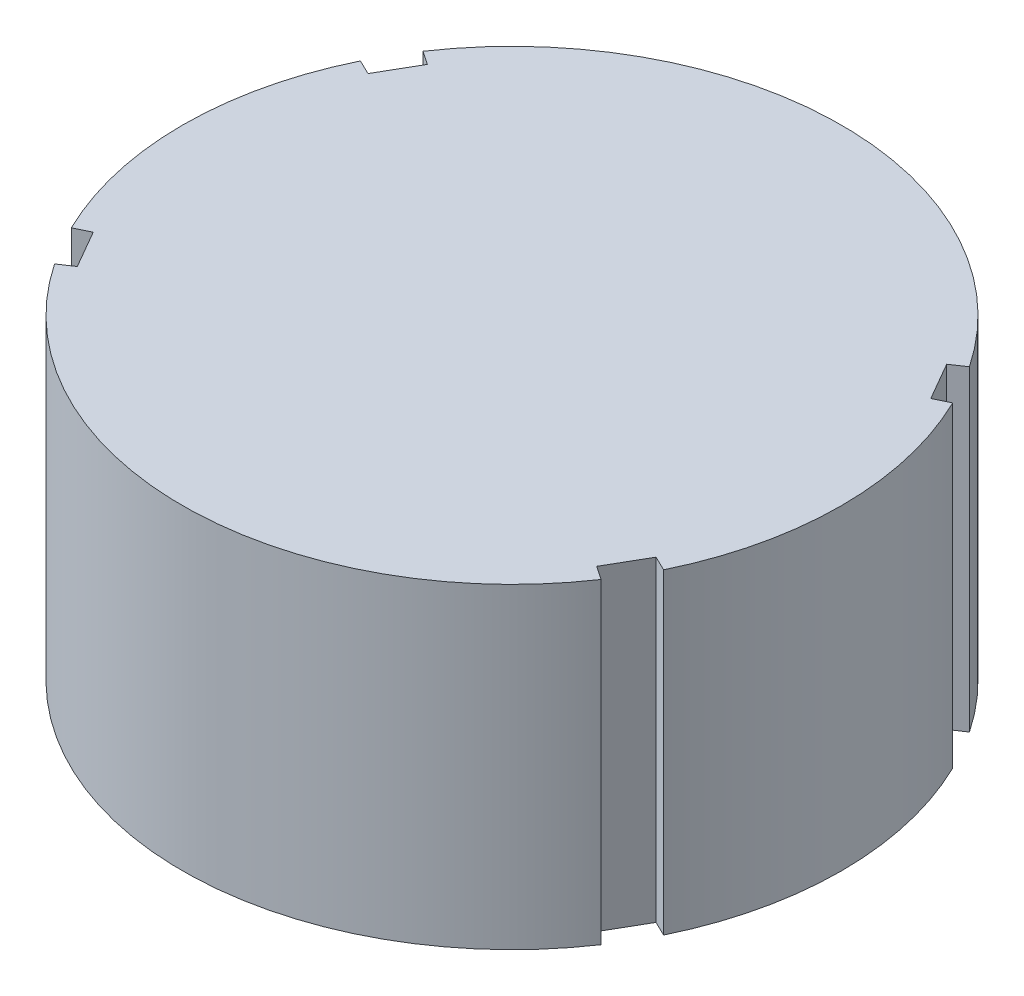
ISO-10303-21;
HEADER;
FILE_DESCRIPTION(('STEP AP214'),'2;1');
FILE_NAME('part.step','',(''),(''),'','','');
FILE_SCHEMA(('AUTOMOTIVE_DESIGN { 1 0 10303 214 1 1 1 1 }'));
ENDSEC;
DATA;
#1=APPLICATION_CONTEXT('core data for automotive mechanical design processes');
#2=APPLICATION_PROTOCOL_DEFINITION('international standard','automotive_design',2000,#1);
#3=PRODUCT_CONTEXT('',#1,'mechanical');
#4=PRODUCT('Part','Part','',(#3));
#5=PRODUCT_RELATED_PRODUCT_CATEGORY('part','',(#4));
#6=PRODUCT_DEFINITION_FORMATION('','',#4);
#7=PRODUCT_DEFINITION_CONTEXT('part definition',#1,'design');
#8=PRODUCT_DEFINITION('design','',#6,#7);
#9=PRODUCT_DEFINITION_SHAPE('','',#8);
#10=(LENGTH_UNIT() NAMED_UNIT(*) SI_UNIT(.MILLI.,.METRE.));
#11=(NAMED_UNIT(*) PLANE_ANGLE_UNIT() SI_UNIT($,.RADIAN.));
#12=(NAMED_UNIT(*) SI_UNIT($,.STERADIAN.) SOLID_ANGLE_UNIT());
#13=UNCERTAINTY_MEASURE_WITH_UNIT(LENGTH_MEASURE(1.E-05),#10,'distance_accuracy_value','');
#14=(GEOMETRIC_REPRESENTATION_CONTEXT(3) GLOBAL_UNCERTAINTY_ASSIGNED_CONTEXT((#13)) GLOBAL_UNIT_ASSIGNED_CONTEXT((#10,
#11,#12)) REPRESENTATION_CONTEXT('',''));
#15=CARTESIAN_POINT('',(0.,0.,0.));
#16=DIRECTION('',(0.,0.,1.));
#17=DIRECTION('',(1.,0.,0.));
#18=AXIS2_PLACEMENT_3D('',#15,#16,#17);
#19=CARTESIAN_POINT('',(-20.5248020696783,24.,-11.850000000011));
#20=DIRECTION('',(-0.866025403784102,0.,-0.500000000000584));
#21=DIRECTION('',(-0.500000000000584,0.,0.866025403784102));
#22=AXIS2_PLACEMENT_3D('',#19,#20,#21);
#23=PLANE('',#22);
#24=DIRECTION('',(0.500000000000584,0.,-0.866025403784102));
#25=VECTOR('',#24,1.);
#26=CARTESIAN_POINT('',(-20.5248020696783,0.,-11.850000000011));
#27=LINE('',#26,#25);
#28=CARTESIAN_POINT('',(-21.3498020696849,0.,-10.4210580837576));
#29=VERTEX_POINT('',#28);
#30=CARTESIAN_POINT('',(-19.699802069683,0.,-13.2789419162451));
#31=VERTEX_POINT('',#30);
#32=EDGE_CURVE('E192',#29,#31,#27,.T.);
#33=ORIENTED_EDGE('',*,*,#32,.F.);
#34=DIRECTION('',(0.,-1.,0.));
#35=VECTOR('',#34,1.);
#36=CARTESIAN_POINT('',(-21.3498020696849,24.,-10.4210580837576));
#37=LINE('',#36,#35);
#38=CARTESIAN_POINT('',(-21.3498020696849,24.,-10.4210580837576));
#39=VERTEX_POINT('',#38);
#40=EDGE_CURVE('E11',#39,#29,#37,.T.);
#41=ORIENTED_EDGE('',*,*,#40,.F.);
#42=DIRECTION('',(0.500000000000584,0.,-0.866025403784102));
#43=VECTOR('',#42,1.);
#44=CARTESIAN_POINT('',(-20.5248020696783,24.,-11.850000000011));
#45=LINE('',#44,#43);
#46=CARTESIAN_POINT('',(-19.699802069683,24.,-13.2789419162451));
#47=VERTEX_POINT('',#46);
#48=EDGE_CURVE('E249',#39,#47,#45,.T.);
#49=ORIENTED_EDGE('',*,*,#48,.T.);
#50=DIRECTION('',(0.,-1.,0.));
#51=VECTOR('',#50,1.);
#52=CARTESIAN_POINT('',(-19.699802069683,24.,-13.2789419162451));
#53=LINE('',#52,#51);
#54=EDGE_CURVE('E62',#47,#31,#53,.T.);
#55=ORIENTED_EDGE('',*,*,#54,.T.);
#56=EDGE_LOOP('',(#33,#41,#49,#55));
#57=FACE_BOUND('',#56,.T.);
#58=ADVANCED_FACE('F45',(#57),#23,.T.);
#59=CARTESIAN_POINT('',(-5.03430191318069E-12,24.,1.03138614660285E-11));
#60=DIRECTION('',(-0.438645324696902,0.,0.898660269023589));
#61=DIRECTION('',(0.898660269023589,0.,0.438645324696902));
#62=AXIS2_PLACEMENT_3D('',#59,#60,#61);
#63=PLANE('',#62);
#64=DIRECTION('',(-0.898660269023589,0.,-0.438645324696902));
#65=VECTOR('',#64,1.);
#66=CARTESIAN_POINT('',(-5.03430191318069E-12,0.,1.03138614660285E-11));
#67=LINE('',#66,#65);
#68=CARTESIAN_POINT('',(-22.46650672559,0.,-10.9661331174099));
#69=VERTEX_POINT('',#68);
#70=EDGE_CURVE('E195',#29,#69,#67,.T.);
#71=ORIENTED_EDGE('',*,*,#70,.T.);
#72=DIRECTION('',(0.,-1.,0.));
#73=VECTOR('',#72,1.);
#74=CARTESIAN_POINT('',(-22.46650672559,24.,-10.9661331174099));
#75=LINE('',#74,#73);
#76=CARTESIAN_POINT('',(-22.46650672559,24.,-10.9661331174099));
#77=VERTEX_POINT('',#76);
#78=EDGE_CURVE('E54',#77,#69,#75,.T.);
#79=ORIENTED_EDGE('',*,*,#78,.F.);
#80=DIRECTION('',(-0.898660269023589,0.,-0.438645324696902));
#81=VECTOR('',#80,1.);
#82=CARTESIAN_POINT('',(-5.03430191318069E-12,24.,1.03138614660285E-11));
#83=LINE('',#82,#81);
#84=EDGE_CURVE('E317',#39,#77,#83,.T.);
#85=ORIENTED_EDGE('',*,*,#84,.F.);
#86=ORIENTED_EDGE('',*,*,#40,.T.);
#87=EDGE_LOOP('',(#71,#79,#85,#86));
#88=FACE_BOUND('',#87,.T.);
#89=ADVANCED_FACE('F359',(#88),#63,.F.);
#90=CARTESIAN_POINT('',(0.,24.,0.));
#91=DIRECTION('',(0.,-1.,0.));
#92=DIRECTION('',(0.,0.,-1.));
#93=AXIS2_PLACEMENT_3D('',#90,#91,#92);
#94=CYLINDRICAL_SURFACE('',#93,25.);
#95=CARTESIAN_POINT('',(0.,0.,0.));
#96=DIRECTION('',(0.,1.,0.));
#97=DIRECTION('',(0.,0.,1.));
#98=AXIS2_PLACEMENT_3D('',#95,#96,#97);
#99=CIRCLE('',#98,25.);
#100=CARTESIAN_POINT('',(-22.4665067255956,0.,10.966133117409));
#101=VERTEX_POINT('',#100);
#102=EDGE_CURVE('E198',#69,#101,#99,.T.);
#103=ORIENTED_EDGE('',*,*,#102,.T.);
#104=DIRECTION('',(0.,-1.,0.));
#105=VECTOR('',#104,1.);
#106=CARTESIAN_POINT('',(-22.4665067255956,24.,10.966133117409));
#107=LINE('',#106,#105);
#108=CARTESIAN_POINT('',(-22.4665067255956,24.,10.966133117409));
#109=VERTEX_POINT('',#108);
#110=EDGE_CURVE('E285',#109,#101,#107,.T.);
#111=ORIENTED_EDGE('',*,*,#110,.F.);
#112=CARTESIAN_POINT('',(0.,24.,0.));
#113=DIRECTION('',(0.,1.,0.));
#114=DIRECTION('',(0.,0.,1.));
#115=AXIS2_PLACEMENT_3D('',#112,#113,#114);
#116=CIRCLE('',#115,25.);
#117=EDGE_CURVE('E295',#77,#109,#116,.T.);
#118=ORIENTED_EDGE('',*,*,#117,.F.);
#119=ORIENTED_EDGE('',*,*,#78,.T.);
#120=EDGE_LOOP('',(#103,#111,#118,#119));
#121=FACE_BOUND('',#120,.T.);
#122=ADVANCED_FACE('F293',(#121),#94,.T.);
#123=CARTESIAN_POINT('',(6.4077775711597E-12,24.,1.31277248194491E-11));
#124=DIRECTION('',(0.438645324695846,0.,0.898660269024104));
#125=DIRECTION('',(0.898660269024104,0.,-0.438645324695847));
#126=AXIS2_PLACEMENT_3D('',#123,#124,#125);
#127=PLANE('',#126);
#128=DIRECTION('',(-0.898660269024104,0.,0.438645324695847));
#129=VECTOR('',#128,1.);
#130=CARTESIAN_POINT('',(6.4077775711597E-12,0.,1.31277248194491E-11));
#131=LINE('',#130,#129);
#132=CARTESIAN_POINT('',(-21.3498020696898,0.,10.421058083758));
#133=VERTEX_POINT('',#132);
#134=EDGE_CURVE('E202',#133,#101,#131,.T.);
#135=ORIENTED_EDGE('',*,*,#134,.F.);
#136=DIRECTION('',(0.,-1.,0.));
#137=VECTOR('',#136,1.);
#138=CARTESIAN_POINT('',(-21.3498020696898,24.,10.421058083758));
#139=LINE('',#138,#137);
#140=CARTESIAN_POINT('',(-21.3498020696898,24.,10.421058083758));
#141=VERTEX_POINT('',#140);
#142=EDGE_CURVE('E282',#141,#133,#139,.T.);
#143=ORIENTED_EDGE('',*,*,#142,.F.);
#144=DIRECTION('',(-0.898660269024104,0.,0.438645324695847));
#145=VECTOR('',#144,1.);
#146=CARTESIAN_POINT('',(6.4077775711597E-12,24.,1.31277248194491E-11));
#147=LINE('',#146,#145);
#148=EDGE_CURVE('E307',#141,#109,#147,.T.);
#149=ORIENTED_EDGE('',*,*,#148,.T.);
#150=ORIENTED_EDGE('',*,*,#110,.T.);
#151=EDGE_LOOP('',(#135,#143,#149,#150));
#152=FACE_BOUND('',#151,.T.);
#153=ADVANCED_FACE('F304',(#152),#127,.T.);
#154=CARTESIAN_POINT('',(-20.5248020696979,24.,11.84999999999));
#155=DIRECTION('',(-0.866025403784691,0.,0.499999999999563));
#156=DIRECTION('',(0.499999999999563,0.,0.866025403784691));
#157=AXIS2_PLACEMENT_3D('',#154,#155,#156);
#158=PLANE('',#157);
#159=DIRECTION('',(-0.499999999999563,0.,-0.866025403784691));
#160=VECTOR('',#159,1.);
#161=CARTESIAN_POINT('',(-20.5248020696979,0.,11.84999999999));
#162=LINE('',#161,#160);
#163=CARTESIAN_POINT('',(-19.6998020696913,0.,13.2789419162475));
#164=VERTEX_POINT('',#163);
#165=EDGE_CURVE('E206',#164,#133,#162,.T.);
#166=ORIENTED_EDGE('',*,*,#165,.F.);
#167=DIRECTION('',(0.,-1.,0.));
#168=VECTOR('',#167,1.);
#169=CARTESIAN_POINT('',(-19.6998020696913,24.,13.2789419162475));
#170=LINE('',#169,#168);
#171=CARTESIAN_POINT('',(-19.6998020696913,24.,13.2789419162475));
#172=VERTEX_POINT('',#171);
#173=EDGE_CURVE('E279',#172,#164,#170,.T.);
#174=ORIENTED_EDGE('',*,*,#173,.F.);
#175=DIRECTION('',(-0.499999999999563,0.,-0.866025403784691));
#176=VECTOR('',#175,1.);
#177=CARTESIAN_POINT('',(-20.5248020696979,24.,11.84999999999));
#178=LINE('',#177,#176);
#179=EDGE_CURVE('E311',#172,#141,#178,.T.);
#180=ORIENTED_EDGE('',*,*,#179,.T.);
#181=ORIENTED_EDGE('',*,*,#142,.T.);
#182=EDGE_LOOP('',(#166,#174,#180,#181));
#183=FACE_BOUND('',#182,.T.);
#184=ADVANCED_FACE('F370',(#183),#158,.T.);
#185=CARTESIAN_POINT('',(8.14469267026672E-12,24.,1.20829531851943E-11));
#186=DIRECTION('',(0.558939959997872,0.,0.829208128950493));
#187=DIRECTION('',(0.829208128950493,0.,-0.558939959997872));
#188=AXIS2_PLACEMENT_3D('',#185,#186,#187);
#189=PLANE('',#188);
#190=DIRECTION('',(-0.829208128950493,0.,0.558939959997873));
#191=VECTOR('',#190,1.);
#192=CARTESIAN_POINT('',(8.14469267026672E-12,0.,1.20829531851943E-11));
#193=LINE('',#192,#191);
#194=CARTESIAN_POINT('',(-20.7302032237553,0.,13.9734989999597));
#195=VERTEX_POINT('',#194);
#196=EDGE_CURVE('E210',#164,#195,#193,.T.);
#197=ORIENTED_EDGE('',*,*,#196,.T.);
#198=DIRECTION('',(0.,-1.,0.));
#199=VECTOR('',#198,1.);
#200=CARTESIAN_POINT('',(-20.7302032237553,24.,13.9734989999597));
#201=LINE('',#200,#199);
#202=CARTESIAN_POINT('',(-20.7302032237553,24.,13.9734989999597));
#203=VERTEX_POINT('',#202);
#204=EDGE_CURVE('E275',#203,#195,#201,.T.);
#205=ORIENTED_EDGE('',*,*,#204,.F.);
#206=DIRECTION('',(-0.829208128950493,0.,0.558939959997873));
#207=VECTOR('',#206,1.);
#208=CARTESIAN_POINT('',(8.14469267026672E-12,24.,1.20829531851943E-11));
#209=LINE('',#208,#207);
#210=EDGE_CURVE('E315',#172,#203,#209,.T.);
#211=ORIENTED_EDGE('',*,*,#210,.F.);
#212=ORIENTED_EDGE('',*,*,#173,.T.);
#213=EDGE_LOOP('',(#197,#205,#211,#212));
#214=FACE_BOUND('',#213,.T.);
#215=ADVANCED_FACE('F373',(#214),#189,.F.);
#216=CARTESIAN_POINT('',(0.,24.,0.));
#217=DIRECTION('',(0.,-1.,0.));
#218=DIRECTION('',(0.,0.,-1.));
#219=AXIS2_PLACEMENT_3D('',#216,#217,#218);
#220=CYLINDRICAL_SURFACE('',#219,25.);
#221=CARTESIAN_POINT('',(0.,0.,0.));
#222=DIRECTION('',(0.,1.,0.));
#223=DIRECTION('',(0.,0.,1.));
#224=AXIS2_PLACEMENT_3D('',#221,#222,#223);
#225=CIRCLE('',#224,25.);
#226=CARTESIAN_POINT('',(20.7302032237602,0.,13.9734989999609));
#227=VERTEX_POINT('',#226);
#228=EDGE_CURVE('E213',#195,#227,#225,.T.);
#229=ORIENTED_EDGE('',*,*,#228,.T.);
#230=DIRECTION('',(0.,-1.,0.));
#231=VECTOR('',#230,1.);
#232=CARTESIAN_POINT('',(20.7302032237602,24.,13.9734989999609));
#233=LINE('',#232,#231);
#234=CARTESIAN_POINT('',(20.7302032237602,24.,13.9734989999609));
#235=VERTEX_POINT('',#234);
#236=EDGE_CURVE('E272',#235,#227,#233,.T.);
#237=ORIENTED_EDGE('',*,*,#236,.F.);
#238=CARTESIAN_POINT('',(0.,24.,0.));
#239=DIRECTION('',(0.,1.,0.));
#240=DIRECTION('',(0.,0.,1.));
#241=AXIS2_PLACEMENT_3D('',#238,#239,#240);
#242=CIRCLE('',#241,25.);
#243=EDGE_CURVE('E323',#203,#235,#242,.T.);
#244=ORIENTED_EDGE('',*,*,#243,.F.);
#245=ORIENTED_EDGE('',*,*,#204,.T.);
#246=EDGE_LOOP('',(#229,#237,#244,#245));
#247=FACE_BOUND('',#246,.T.);
#248=ADVANCED_FACE('F377',(#247),#220,.T.);
#249=CARTESIAN_POINT('',(2.15058670746066E-12,24.,-3.19047501961295E-12));
#250=DIRECTION('',(0.558939959998427,0.,-0.829208128950119));
#251=DIRECTION('',(-0.829208128950119,0.,-0.558939959998427));
#252=AXIS2_PLACEMENT_3D('',#249,#250,#251);
#253=PLANE('',#252);
#254=DIRECTION('',(0.829208128950119,0.,0.558939959998427));
#255=VECTOR('',#254,1.);
#256=CARTESIAN_POINT('',(2.15058670746066E-12,0.,-3.19047501961295E-12));
#257=LINE('',#256,#255);
#258=CARTESIAN_POINT('',(19.6998020696967,0.,13.278941916248));
#259=VERTEX_POINT('',#258);
#260=EDGE_CURVE('E217',#259,#227,#257,.T.);
#261=ORIENTED_EDGE('',*,*,#260,.F.);
#262=DIRECTION('',(0.,-1.,0.));
#263=VECTOR('',#262,1.);
#264=CARTESIAN_POINT('',(19.6998020696967,24.,13.278941916248));
#265=LINE('',#264,#263);
#266=CARTESIAN_POINT('',(19.6998020696967,24.,13.278941916248));
#267=VERTEX_POINT('',#266);
#268=EDGE_CURVE('E269',#267,#259,#265,.T.);
#269=ORIENTED_EDGE('',*,*,#268,.F.);
#270=DIRECTION('',(0.829208128950119,0.,0.558939959998427));
#271=VECTOR('',#270,1.);
#272=CARTESIAN_POINT('',(2.15058670746066E-12,24.,-3.19047501961295E-12));
#273=LINE('',#272,#271);
#274=EDGE_CURVE('E326',#267,#235,#273,.T.);
#275=ORIENTED_EDGE('',*,*,#274,.T.);
#276=ORIENTED_EDGE('',*,*,#236,.T.);
#277=EDGE_LOOP('',(#261,#269,#275,#276));
#278=FACE_BOUND('',#277,.T.);
#279=ADVANCED_FACE('F381',(#278),#253,.T.);
#280=CARTESIAN_POINT('',(20.5248020696952,24.,11.8500000000069));
#281=DIRECTION('',(0.866025403784354,0.,0.500000000000146));
#282=DIRECTION('',(0.500000000000146,0.,-0.866025403784355));
#283=AXIS2_PLACEMENT_3D('',#280,#281,#282);
#284=PLANE('',#283);
#285=DIRECTION('',(-0.500000000000146,0.,0.866025403784354));
#286=VECTOR('',#285,1.);
#287=CARTESIAN_POINT('',(20.5248020696952,0.,11.8500000000069));
#288=LINE('',#287,#286);
#289=CARTESIAN_POINT('',(21.3498020696972,0.,10.4210580837597));
#290=VERTEX_POINT('',#289);
#291=EDGE_CURVE('E221',#290,#259,#288,.T.);
#292=ORIENTED_EDGE('',*,*,#291,.F.);
#293=DIRECTION('',(0.,-1.,0.));
#294=VECTOR('',#293,1.);
#295=CARTESIAN_POINT('',(21.3498020696972,24.,10.4210580837597));
#296=LINE('',#295,#294);
#297=CARTESIAN_POINT('',(21.3498020696972,24.,10.4210580837597));
#298=VERTEX_POINT('',#297);
#299=EDGE_CURVE('E266',#298,#290,#296,.T.);
#300=ORIENTED_EDGE('',*,*,#299,.F.);
#301=DIRECTION('',(-0.500000000000146,0.,0.866025403784354));
#302=VECTOR('',#301,1.);
#303=CARTESIAN_POINT('',(20.5248020696952,24.,11.8500000000069));
#304=LINE('',#303,#302);
#305=EDGE_CURVE('E330',#298,#267,#304,.T.);
#306=ORIENTED_EDGE('',*,*,#305,.T.);
#307=ORIENTED_EDGE('',*,*,#268,.T.);
#308=EDGE_LOOP('',(#292,#300,#306,#307));
#309=FACE_BOUND('',#308,.T.);
#310=ADVANCED_FACE('F385',(#309),#284,.T.);
#311=CARTESIAN_POINT('',(1.33086367081982E-12,24.,-2.72656343774006E-12));
#312=DIRECTION('',(0.43864532469645,0.,-0.89866026902381));
#313=DIRECTION('',(-0.89866026902381,0.,-0.43864532469645));
#314=AXIS2_PLACEMENT_3D('',#311,#312,#313);
#315=PLANE('',#314);
#316=DIRECTION('',(0.89866026902381,0.,0.43864532469645));
#317=VECTOR('',#316,1.);
#318=CARTESIAN_POINT('',(1.33086367081982E-12,0.,-2.72656343774006E-12));
#319=LINE('',#318,#317);
#320=CARTESIAN_POINT('',(22.4665067256026,0.,10.9661331174114));
#321=VERTEX_POINT('',#320);
#322=EDGE_CURVE('E225',#290,#321,#319,.T.);
#323=ORIENTED_EDGE('',*,*,#322,.T.);
#324=DIRECTION('',(0.,-1.,0.));
#325=VECTOR('',#324,1.);
#326=CARTESIAN_POINT('',(22.4665067256026,24.,10.9661331174114));
#327=LINE('',#326,#325);
#328=CARTESIAN_POINT('',(22.4665067256026,24.,10.9661331174114));
#329=VERTEX_POINT('',#328);
#330=EDGE_CURVE('E262',#329,#321,#327,.T.);
#331=ORIENTED_EDGE('',*,*,#330,.F.);
#332=DIRECTION('',(0.89866026902381,0.,0.43864532469645));
#333=VECTOR('',#332,1.);
#334=CARTESIAN_POINT('',(1.33086367081982E-12,24.,-2.72656343774006E-12));
#335=LINE('',#334,#333);
#336=EDGE_CURVE('E334',#298,#329,#335,.T.);
#337=ORIENTED_EDGE('',*,*,#336,.F.);
#338=ORIENTED_EDGE('',*,*,#299,.T.);
#339=EDGE_LOOP('',(#323,#331,#337,#338));
#340=FACE_BOUND('',#339,.T.);
#341=ADVANCED_FACE('F389',(#340),#315,.F.);
#342=CARTESIAN_POINT('',(0.,24.,0.));
#343=DIRECTION('',(0.,-1.,0.));
#344=DIRECTION('',(0.,0.,-1.));
#345=AXIS2_PLACEMENT_3D('',#342,#343,#344);
#346=CYLINDRICAL_SURFACE('',#345,25.);
#347=CARTESIAN_POINT('',(0.,0.,0.));
#348=DIRECTION('',(0.,1.,0.));
#349=DIRECTION('',(0.,0.,1.));
#350=AXIS2_PLACEMENT_3D('',#347,#348,#349);
#351=CIRCLE('',#350,25.);
#352=CARTESIAN_POINT('',(22.4665067255971,0.,-10.9661331174075));
#353=VERTEX_POINT('',#352);
#354=EDGE_CURVE('E228',#321,#353,#351,.T.);
#355=ORIENTED_EDGE('',*,*,#354,.T.);
#356=DIRECTION('',(0.,-1.,0.));
#357=VECTOR('',#356,1.);
#358=CARTESIAN_POINT('',(22.4665067255971,24.,-10.9661331174075));
#359=LINE('',#358,#357);
#360=CARTESIAN_POINT('',(22.4665067255971,24.,-10.9661331174075));
#361=VERTEX_POINT('',#360);
#362=EDGE_CURVE('E259',#361,#353,#359,.T.);
#363=ORIENTED_EDGE('',*,*,#362,.F.);
#364=CARTESIAN_POINT('',(0.,24.,0.));
#365=DIRECTION('',(0.,1.,0.));
#366=DIRECTION('',(0.,0.,1.));
#367=AXIS2_PLACEMENT_3D('',#364,#365,#366);
#368=CIRCLE('',#367,25.);
#369=EDGE_CURVE('E337',#329,#361,#368,.T.);
#370=ORIENTED_EDGE('',*,*,#369,.F.);
#371=ORIENTED_EDGE('',*,*,#330,.T.);
#372=EDGE_LOOP('',(#355,#363,#370,#371));
#373=FACE_BOUND('',#372,.T.);
#374=ADVANCED_FACE('F393',(#373),#346,.T.);
#375=CARTESIAN_POINT('',(0.,24.,0.));
#376=DIRECTION('',(-0.4386453246963,0.,-0.898660269023883));
#377=DIRECTION('',(-0.898660269023883,0.,0.4386453246963));
#378=AXIS2_PLACEMENT_3D('',#375,#376,#377);
#379=PLANE('',#378);
#380=DIRECTION('',(0.898660269023883,0.,-0.4386453246963));
#381=VECTOR('',#380,1.);
#382=CARTESIAN_POINT('',(0.,0.,0.));
#383=LINE('',#382,#381);
#384=CARTESIAN_POINT('',(21.3498020696915,0.,-10.4210580837559));
#385=VERTEX_POINT('',#384);
#386=EDGE_CURVE('E232',#385,#353,#383,.T.);
#387=ORIENTED_EDGE('',*,*,#386,.F.);
#388=DIRECTION('',(0.,-1.,0.));
#389=VECTOR('',#388,1.);
#390=CARTESIAN_POINT('',(21.3498020696915,24.,-10.4210580837559));
#391=LINE('',#390,#389);
#392=CARTESIAN_POINT('',(21.3498020696915,24.,-10.4210580837559));
#393=VERTEX_POINT('',#392);
#394=EDGE_CURVE('E256',#393,#385,#391,.T.);
#395=ORIENTED_EDGE('',*,*,#394,.F.);
#396=DIRECTION('',(0.898660269023883,0.,-0.4386453246963));
#397=VECTOR('',#396,1.);
#398=CARTESIAN_POINT('',(0.,24.,0.));
#399=LINE('',#398,#397);
#400=EDGE_CURVE('E340',#393,#361,#399,.T.);
#401=ORIENTED_EDGE('',*,*,#400,.T.);
#402=ORIENTED_EDGE('',*,*,#362,.T.);
#403=EDGE_LOOP('',(#387,#395,#401,#402));
#404=FACE_BOUND('',#403,.T.);
#405=ADVANCED_FACE('F397',(#404),#379,.T.);
#406=CARTESIAN_POINT('',(20.5248020696915,24.,-11.8500000000002));
#407=DIRECTION('',(0.866025403784438,0.,-0.5));
#408=DIRECTION('',(-0.5,0.,-0.866025403784439));
#409=AXIS2_PLACEMENT_3D('',#406,#407,#408);
#410=PLANE('',#409);
#411=DIRECTION('',(0.5,0.,0.866025403784438));
#412=VECTOR('',#411,1.);
#413=CARTESIAN_POINT('',(20.5248020696915,0.,-11.8500000000002));
#414=LINE('',#413,#412);
#415=CARTESIAN_POINT('',(19.6998020696915,0.,-13.2789419162445));
#416=VERTEX_POINT('',#415);
#417=EDGE_CURVE('E236',#416,#385,#414,.T.);
#418=ORIENTED_EDGE('',*,*,#417,.F.);
#419=DIRECTION('',(0.,-1.,0.));
#420=VECTOR('',#419,1.);
#421=CARTESIAN_POINT('',(19.6998020696915,24.,-13.2789419162445));
#422=LINE('',#421,#420);
#423=CARTESIAN_POINT('',(19.6998020696915,24.,-13.2789419162445));
#424=VERTEX_POINT('',#423);
#425=EDGE_CURVE('E182',#424,#416,#422,.T.);
#426=ORIENTED_EDGE('',*,*,#425,.F.);
#427=DIRECTION('',(0.5,0.,0.866025403784438));
#428=VECTOR('',#427,1.);
#429=CARTESIAN_POINT('',(20.5248020696915,24.,-11.8500000000002));
#430=LINE('',#429,#428);
#431=EDGE_CURVE('E170',#424,#393,#430,.T.);
#432=ORIENTED_EDGE('',*,*,#431,.T.);
#433=ORIENTED_EDGE('',*,*,#394,.T.);
#434=EDGE_LOOP('',(#418,#426,#432,#433));
#435=FACE_BOUND('',#434,.T.);
#436=ADVANCED_FACE('F346',(#435),#410,.T.);
#437=CARTESIAN_POINT('',(0.,24.,0.));
#438=DIRECTION('',(-0.558939959998291,0.,-0.829208128950211));
#439=DIRECTION('',(-0.829208128950211,0.,0.558939959998291));
#440=AXIS2_PLACEMENT_3D('',#437,#438,#439);
#441=PLANE('',#440);
#442=DIRECTION('',(0.829208128950211,0.,-0.558939959998291));
#443=VECTOR('',#442,1.);
#444=CARTESIAN_POINT('',(0.,0.,0.));
#445=LINE('',#444,#443);
#446=CARTESIAN_POINT('',(20.7302032237553,0.,-13.9734989999573));
#447=VERTEX_POINT('',#446);
#448=EDGE_CURVE('E178',#416,#447,#445,.T.);
#449=ORIENTED_EDGE('',*,*,#448,.T.);
#450=DIRECTION('',(0.,-1.,0.));
#451=VECTOR('',#450,1.);
#452=CARTESIAN_POINT('',(20.7302032237553,24.,-13.9734989999573));
#453=LINE('',#452,#451);
#454=CARTESIAN_POINT('',(20.7302032237553,24.,-13.9734989999573));
#455=VERTEX_POINT('',#454);
#456=EDGE_CURVE('E175',#455,#447,#453,.T.);
#457=ORIENTED_EDGE('',*,*,#456,.F.);
#458=DIRECTION('',(0.829208128950211,0.,-0.558939959998291));
#459=VECTOR('',#458,1.);
#460=CARTESIAN_POINT('',(0.,24.,0.));
#461=LINE('',#460,#459);
#462=EDGE_CURVE('E161',#424,#455,#461,.T.);
#463=ORIENTED_EDGE('',*,*,#462,.F.);
#464=ORIENTED_EDGE('',*,*,#425,.T.);
#465=EDGE_LOOP('',(#449,#457,#463,#464));
#466=FACE_BOUND('',#465,.T.);
#467=ADVANCED_FACE('F176',(#466),#441,.F.);
#468=CARTESIAN_POINT('',(0.,24.,0.));
#469=DIRECTION('',(0.,-1.,0.));
#470=DIRECTION('',(0.,0.,-1.));
#471=AXIS2_PLACEMENT_3D('',#468,#469,#470);
#472=CYLINDRICAL_SURFACE('',#471,25.);
#473=CARTESIAN_POINT('',(0.,0.,0.));
#474=DIRECTION('',(0.,1.,0.));
#475=DIRECTION('',(0.,0.,1.));
#476=AXIS2_PLACEMENT_3D('',#473,#474,#475);
#477=CIRCLE('',#476,25.);
#478=CARTESIAN_POINT('',(-20.7302032237462,0.,-13.9734989999586));
#479=VERTEX_POINT('',#478);
#480=EDGE_CURVE('E242',#447,#479,#477,.T.);
#481=ORIENTED_EDGE('',*,*,#480,.T.);
#482=DIRECTION('',(0.,-1.,0.));
#483=VECTOR('',#482,1.);
#484=CARTESIAN_POINT('',(-20.7302032237462,24.,-13.9734989999586));
#485=LINE('',#484,#483);
#486=CARTESIAN_POINT('',(-20.7302032237462,24.,-13.9734989999586));
#487=VERTEX_POINT('',#486);
#488=EDGE_CURVE('E112',#487,#479,#485,.T.);
#489=ORIENTED_EDGE('',*,*,#488,.F.);
#490=CARTESIAN_POINT('',(0.,24.,0.));
#491=DIRECTION('',(0.,1.,0.));
#492=DIRECTION('',(0.,0.,1.));
#493=AXIS2_PLACEMENT_3D('',#490,#491,#492);
#494=CIRCLE('',#493,25.);
#495=EDGE_CURVE('E167',#455,#487,#494,.T.);
#496=ORIENTED_EDGE('',*,*,#495,.F.);
#497=ORIENTED_EDGE('',*,*,#456,.T.);
#498=EDGE_LOOP('',(#481,#489,#496,#497));
#499=FACE_BOUND('',#498,.T.);
#500=ADVANCED_FACE('F184',(#499),#472,.T.);
#501=CARTESIAN_POINT('',(-5.92138549254827E-12,24.,8.78459465499084E-12));
#502=DIRECTION('',(-0.558939959998846,0.,0.829208128949836));
#503=DIRECTION('',(0.829208128949837,0.,0.558939959998846));
#504=AXIS2_PLACEMENT_3D('',#501,#502,#503);
#505=PLANE('',#504);
#506=DIRECTION('',(-0.829208128949836,0.,-0.558939959998846));
#507=VECTOR('',#506,1.);
#508=CARTESIAN_POINT('',(-5.92138549254827E-12,0.,8.78459465499084E-12));
#509=LINE('',#508,#507);
#510=EDGE_CURVE('E245',#31,#479,#509,.T.);
#511=ORIENTED_EDGE('',*,*,#510,.F.);
#512=ORIENTED_EDGE('',*,*,#54,.F.);
#513=DIRECTION('',(-0.829208128949836,0.,-0.558939959998846));
#514=VECTOR('',#513,1.);
#515=CARTESIAN_POINT('',(-5.92138549254827E-12,24.,8.78459465499084E-12));
#516=LINE('',#515,#514);
#517=EDGE_CURVE('E186',#47,#487,#516,.T.);
#518=ORIENTED_EDGE('',*,*,#517,.T.);
#519=ORIENTED_EDGE('',*,*,#488,.T.);
#520=EDGE_LOOP('',(#511,#512,#518,#519));
#521=FACE_BOUND('',#520,.T.);
#522=ADVANCED_FACE('F348',(#521),#505,.T.);
#523=CARTESIAN_POINT('',(0.,24.,0.));
#524=DIRECTION('',(0.,1.,0.));
#525=DIRECTION('',(0.,0.,1.));
#526=AXIS2_PLACEMENT_3D('',#523,#524,#525);
#527=PLANE('',#526);
#528=ORIENTED_EDGE('',*,*,#48,.F.);
#529=ORIENTED_EDGE('',*,*,#84,.T.);
#530=ORIENTED_EDGE('',*,*,#117,.T.);
#531=ORIENTED_EDGE('',*,*,#148,.F.);
#532=ORIENTED_EDGE('',*,*,#179,.F.);
#533=ORIENTED_EDGE('',*,*,#210,.T.);
#534=ORIENTED_EDGE('',*,*,#243,.T.);
#535=ORIENTED_EDGE('',*,*,#274,.F.);
#536=ORIENTED_EDGE('',*,*,#305,.F.);
#537=ORIENTED_EDGE('',*,*,#336,.T.);
#538=ORIENTED_EDGE('',*,*,#369,.T.);
#539=ORIENTED_EDGE('',*,*,#400,.F.);
#540=ORIENTED_EDGE('',*,*,#431,.F.);
#541=ORIENTED_EDGE('',*,*,#462,.T.);
#542=ORIENTED_EDGE('',*,*,#495,.T.);
#543=ORIENTED_EDGE('',*,*,#517,.F.);
#544=EDGE_LOOP('',(#528,#529,#530,#531,#532,#533,#534,#535,#536,#537,#538,#539,#540,#541,#542,#543));
#545=FACE_BOUND('',#544,.T.);
#546=ADVANCED_FACE('F164',(#545),#527,.T.);
#547=CARTESIAN_POINT('',(0.,0.,0.));
#548=DIRECTION('',(0.,1.,0.));
#549=DIRECTION('',(0.,0.,1.));
#550=AXIS2_PLACEMENT_3D('',#547,#548,#549);
#551=PLANE('',#550);
#552=ORIENTED_EDGE('',*,*,#32,.T.);
#553=ORIENTED_EDGE('',*,*,#510,.T.);
#554=ORIENTED_EDGE('',*,*,#480,.F.);
#555=ORIENTED_EDGE('',*,*,#448,.F.);
#556=ORIENTED_EDGE('',*,*,#417,.T.);
#557=ORIENTED_EDGE('',*,*,#386,.T.);
#558=ORIENTED_EDGE('',*,*,#354,.F.);
#559=ORIENTED_EDGE('',*,*,#322,.F.);
#560=ORIENTED_EDGE('',*,*,#291,.T.);
#561=ORIENTED_EDGE('',*,*,#260,.T.);
#562=ORIENTED_EDGE('',*,*,#228,.F.);
#563=ORIENTED_EDGE('',*,*,#196,.F.);
#564=ORIENTED_EDGE('',*,*,#165,.T.);
#565=ORIENTED_EDGE('',*,*,#134,.T.);
#566=ORIENTED_EDGE('',*,*,#102,.F.);
#567=ORIENTED_EDGE('',*,*,#70,.F.);
#568=EDGE_LOOP('',(#552,#553,#554,#555,#556,#557,#558,#559,#560,#561,#562,#563,#564,#565,#566,#567));
#569=FACE_BOUND('',#568,.T.);
#570=ADVANCED_FACE('F299',(#569),#551,.F.);
#571=CLOSED_SHELL('',(#58,#89,#122,#153,#184,#215,#248,#279,#310,#341,#374,#405,#436,#467,#500,
#522,#546,#570));
#572=MANIFOLD_SOLID_BREP('B2',#571);
#573=ADVANCED_BREP_SHAPE_REPRESENTATION('',(#18,#572),#14);
#574=SHAPE_DEFINITION_REPRESENTATION(#9,#573);
ENDSEC;
END-ISO-10303-21;
